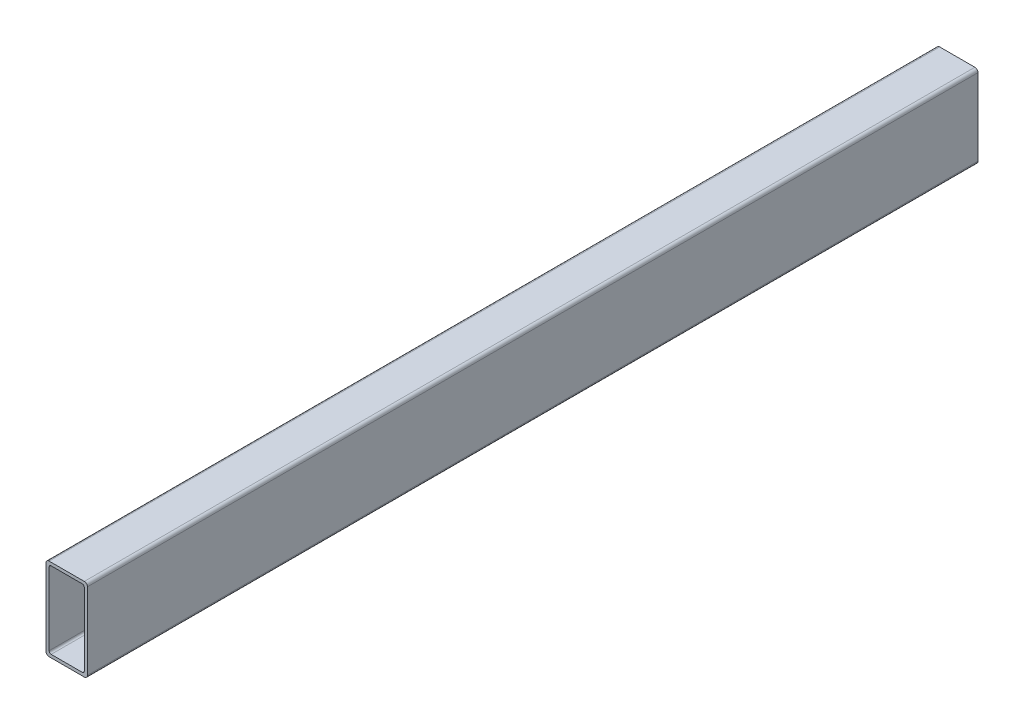
ISO-10303-21;
HEADER;
FILE_DESCRIPTION(('STEP AP214'),'2;1');
FILE_NAME('part.step','',(''),(''),'','','');
FILE_SCHEMA(('AUTOMOTIVE_DESIGN { 1 0 10303 214 1 1 1 1 }'));
ENDSEC;
DATA;
#1=APPLICATION_CONTEXT('core data for automotive mechanical design processes');
#2=APPLICATION_PROTOCOL_DEFINITION('international standard','automotive_design',2000,#1);
#3=PRODUCT_CONTEXT('',#1,'mechanical');
#4=PRODUCT('Part','Part','',(#3));
#5=PRODUCT_RELATED_PRODUCT_CATEGORY('part','',(#4));
#6=PRODUCT_DEFINITION_FORMATION('','',#4);
#7=PRODUCT_DEFINITION_CONTEXT('part definition',#1,'design');
#8=PRODUCT_DEFINITION('design','',#6,#7);
#9=PRODUCT_DEFINITION_SHAPE('','',#8);
#10=(LENGTH_UNIT() NAMED_UNIT(*) SI_UNIT(.MILLI.,.METRE.));
#11=(NAMED_UNIT(*) PLANE_ANGLE_UNIT() SI_UNIT($,.RADIAN.));
#12=(NAMED_UNIT(*) SI_UNIT($,.STERADIAN.) SOLID_ANGLE_UNIT());
#13=UNCERTAINTY_MEASURE_WITH_UNIT(LENGTH_MEASURE(1.E-05),#10,'distance_accuracy_value','');
#14=(GEOMETRIC_REPRESENTATION_CONTEXT(3) GLOBAL_UNCERTAINTY_ASSIGNED_CONTEXT((#13)) GLOBAL_UNIT_ASSIGNED_CONTEXT((#10,
#11,#12)) REPRESENTATION_CONTEXT('',''));
#15=CARTESIAN_POINT('',(0.,0.,0.));
#16=DIRECTION('',(0.,0.,1.));
#17=DIRECTION('',(1.,0.,0.));
#18=AXIS2_PLACEMENT_3D('',#15,#16,#17);
#19=CARTESIAN_POINT('',(18.5000000000001,38.5000000000001,259.721359549996));
#20=DIRECTION('',(0.,0.,-1.));
#21=DIRECTION('',(-1.,0.,0.));
#22=AXIS2_PLACEMENT_3D('',#19,#20,#21);
#23=CYLINDRICAL_SURFACE('',#22,1.5);
#24=DIRECTION('',(0.,0.,-1.));
#25=VECTOR('',#24,1.);
#26=CARTESIAN_POINT('',(18.5,40.0000000000001,259.721359549996));
#27=LINE('',#26,#25);
#28=CARTESIAN_POINT('',(18.5,40.0000000000001,215.));
#29=VERTEX_POINT('',#28);
#30=CARTESIAN_POINT('',(18.5,40.0000000000001,-215.));
#31=VERTEX_POINT('',#30);
#32=EDGE_CURVE('E109',#29,#31,#27,.T.);
#33=ORIENTED_EDGE('',*,*,#32,.F.);
#34=CARTESIAN_POINT('',(18.5000000000001,38.5000000000001,215.));
#35=DIRECTION('',(0.,0.,-1.));
#36=DIRECTION('',(0.,1.,0.));
#37=AXIS2_PLACEMENT_3D('',#34,#35,#36);
#38=CIRCLE('',#37,1.5);
#39=CARTESIAN_POINT('',(20.0000000000001,38.5000000000001,215.));
#40=VERTEX_POINT('',#39);
#41=EDGE_CURVE('E53',#29,#40,#38,.T.);
#42=ORIENTED_EDGE('',*,*,#41,.T.);
#43=DIRECTION('',(0.,0.,-1.));
#44=VECTOR('',#43,1.);
#45=CARTESIAN_POINT('',(20.0000000000001,38.5000000000001,259.721359549996));
#46=LINE('',#45,#44);
#47=CARTESIAN_POINT('',(20.0000000000001,38.5000000000001,-215.));
#48=VERTEX_POINT('',#47);
#49=EDGE_CURVE('E189',#40,#48,#46,.T.);
#50=ORIENTED_EDGE('',*,*,#49,.T.);
#51=CARTESIAN_POINT('',(18.5000000000001,38.5000000000001,-215.));
#52=DIRECTION('',(0.,0.,-1.));
#53=DIRECTION('',(0.,1.,0.));
#54=AXIS2_PLACEMENT_3D('',#51,#52,#53);
#55=CIRCLE('',#54,1.5);
#56=EDGE_CURVE('E273',#31,#48,#55,.T.);
#57=ORIENTED_EDGE('',*,*,#56,.F.);
#58=EDGE_LOOP('',(#33,#42,#50,#57));
#59=FACE_BOUND('',#58,.T.);
#60=ADVANCED_FACE('F34',(#59),#23,.T.);
#61=CARTESIAN_POINT('',(1.50000000000006,40.0000000000001,259.721359549996));
#62=DIRECTION('',(0.,-1.,0.));
#63=DIRECTION('',(0.,0.,-1.));
#64=AXIS2_PLACEMENT_3D('',#61,#62,#63);
#65=PLANE('',#64);
#66=DIRECTION('',(0.,0.,-1.));
#67=VECTOR('',#66,1.);
#68=CARTESIAN_POINT('',(1.50000000000006,40.0000000000001,259.721359549996));
#69=LINE('',#68,#67);
#70=CARTESIAN_POINT('',(1.50000000000006,40.0000000000001,215.));
#71=VERTEX_POINT('',#70);
#72=CARTESIAN_POINT('',(1.50000000000006,40.0000000000001,-215.));
#73=VERTEX_POINT('',#72);
#74=EDGE_CURVE('E140',#71,#73,#69,.T.);
#75=ORIENTED_EDGE('',*,*,#74,.F.);
#76=DIRECTION('',(1.,0.,0.));
#77=VECTOR('',#76,1.);
#78=CARTESIAN_POINT('',(1.50000000000006,40.0000000000001,215.));
#79=LINE('',#78,#77);
#80=EDGE_CURVE('E181',#71,#29,#79,.T.);
#81=ORIENTED_EDGE('',*,*,#80,.T.);
#82=ORIENTED_EDGE('',*,*,#32,.T.);
#83=DIRECTION('',(1.,0.,0.));
#84=VECTOR('',#83,1.);
#85=CARTESIAN_POINT('',(1.50000000000006,40.0000000000001,-215.));
#86=LINE('',#85,#84);
#87=EDGE_CURVE('E230',#73,#31,#86,.T.);
#88=ORIENTED_EDGE('',*,*,#87,.F.);
#89=EDGE_LOOP('',(#75,#81,#82,#88));
#90=FACE_BOUND('',#89,.T.);
#91=ADVANCED_FACE('F334',(#90),#65,.F.);
#92=CARTESIAN_POINT('',(1.50000000000006,38.5000000000001,259.721359549996));
#93=DIRECTION('',(0.,0.,-1.));
#94=DIRECTION('',(-1.,0.,0.));
#95=AXIS2_PLACEMENT_3D('',#92,#93,#94);
#96=CYLINDRICAL_SURFACE('',#95,1.50000000000001);
#97=DIRECTION('',(0.,0.,-1.));
#98=VECTOR('',#97,1.);
#99=CARTESIAN_POINT('',(0.,38.5000000000001,259.721359549996));
#100=LINE('',#99,#98);
#101=CARTESIAN_POINT('',(0.,38.5000000000001,215.));
#102=VERTEX_POINT('',#101);
#103=CARTESIAN_POINT('',(0.,38.5000000000001,-215.));
#104=VERTEX_POINT('',#103);
#105=EDGE_CURVE('E139',#102,#104,#100,.T.);
#106=ORIENTED_EDGE('',*,*,#105,.F.);
#107=CARTESIAN_POINT('',(1.50000000000006,38.5000000000001,215.));
#108=DIRECTION('',(0.,0.,-1.));
#109=DIRECTION('',(0.,1.,0.));
#110=AXIS2_PLACEMENT_3D('',#107,#108,#109);
#111=CIRCLE('',#110,1.50000000000001);
#112=EDGE_CURVE('E135',#102,#71,#111,.T.);
#113=ORIENTED_EDGE('',*,*,#112,.T.);
#114=ORIENTED_EDGE('',*,*,#74,.T.);
#115=CARTESIAN_POINT('',(1.50000000000006,38.5000000000001,-215.));
#116=DIRECTION('',(0.,0.,-1.));
#117=DIRECTION('',(0.,1.,0.));
#118=AXIS2_PLACEMENT_3D('',#115,#116,#117);
#119=CIRCLE('',#118,1.50000000000001);
#120=EDGE_CURVE('E221',#104,#73,#119,.T.);
#121=ORIENTED_EDGE('',*,*,#120,.F.);
#122=EDGE_LOOP('',(#106,#113,#114,#121));
#123=FACE_BOUND('',#122,.T.);
#124=ADVANCED_FACE('F215',(#123),#96,.T.);
#125=CARTESIAN_POINT('',(0.,38.5000000000001,259.721359549996));
#126=DIRECTION('',(1.,0.,0.));
#127=DIRECTION('',(0.,1.,0.));
#128=AXIS2_PLACEMENT_3D('',#125,#126,#127);
#129=PLANE('',#128);
#130=DIRECTION('',(0.,0.,-1.));
#131=VECTOR('',#130,1.);
#132=CARTESIAN_POINT('',(0.,1.50000000000006,259.721359549996));
#133=LINE('',#132,#131);
#134=CARTESIAN_POINT('',(0.,1.50000000000006,215.));
#135=VERTEX_POINT('',#134);
#136=CARTESIAN_POINT('',(0.,1.50000000000006,-215.));
#137=VERTEX_POINT('',#136);
#138=EDGE_CURVE('E144',#135,#137,#133,.T.);
#139=ORIENTED_EDGE('',*,*,#138,.F.);
#140=DIRECTION('',(0.,1.,0.));
#141=VECTOR('',#140,1.);
#142=CARTESIAN_POINT('',(0.,38.5000000000001,215.));
#143=LINE('',#142,#141);
#144=EDGE_CURVE('E129',#135,#102,#143,.T.);
#145=ORIENTED_EDGE('',*,*,#144,.T.);
#146=ORIENTED_EDGE('',*,*,#105,.T.);
#147=DIRECTION('',(0.,1.,0.));
#148=VECTOR('',#147,1.);
#149=CARTESIAN_POINT('',(0.,38.5000000000001,-215.));
#150=LINE('',#149,#148);
#151=EDGE_CURVE('E148',#137,#104,#150,.T.);
#152=ORIENTED_EDGE('',*,*,#151,.F.);
#153=EDGE_LOOP('',(#139,#145,#146,#152));
#154=FACE_BOUND('',#153,.T.);
#155=ADVANCED_FACE('F145',(#154),#129,.F.);
#156=CARTESIAN_POINT('',(1.50000000000006,1.50000000000006,259.721359549996));
#157=DIRECTION('',(0.,0.,-1.));
#158=DIRECTION('',(-1.,0.,0.));
#159=AXIS2_PLACEMENT_3D('',#156,#157,#158);
#160=CYLINDRICAL_SURFACE('',#159,1.5);
#161=DIRECTION('',(0.,0.,-1.));
#162=VECTOR('',#161,1.);
#163=CARTESIAN_POINT('',(1.50000000000006,0.,259.721359549996));
#164=LINE('',#163,#162);
#165=CARTESIAN_POINT('',(1.50000000000006,0.,215.));
#166=VERTEX_POINT('',#165);
#167=CARTESIAN_POINT('',(1.50000000000006,0.,-215.));
#168=VERTEX_POINT('',#167);
#169=EDGE_CURVE('E155',#166,#168,#164,.T.);
#170=ORIENTED_EDGE('',*,*,#169,.F.);
#171=CARTESIAN_POINT('',(1.50000000000006,1.50000000000006,215.));
#172=DIRECTION('',(0.,0.,-1.));
#173=DIRECTION('',(0.,1.,0.));
#174=AXIS2_PLACEMENT_3D('',#171,#172,#173);
#175=CIRCLE('',#174,1.5);
#176=EDGE_CURVE('E132',#166,#135,#175,.T.);
#177=ORIENTED_EDGE('',*,*,#176,.T.);
#178=ORIENTED_EDGE('',*,*,#138,.T.);
#179=CARTESIAN_POINT('',(1.50000000000006,1.50000000000006,-215.));
#180=DIRECTION('',(0.,0.,-1.));
#181=DIRECTION('',(0.,1.,0.));
#182=AXIS2_PLACEMENT_3D('',#179,#180,#181);
#183=CIRCLE('',#182,1.5);
#184=EDGE_CURVE('E226',#168,#137,#183,.T.);
#185=ORIENTED_EDGE('',*,*,#184,.F.);
#186=EDGE_LOOP('',(#170,#177,#178,#185));
#187=FACE_BOUND('',#186,.T.);
#188=ADVANCED_FACE('F153',(#187),#160,.T.);
#189=CARTESIAN_POINT('',(1.50000000000006,0.,259.721359549996));
#190=DIRECTION('',(0.,1.,0.));
#191=DIRECTION('',(0.,0.,1.));
#192=AXIS2_PLACEMENT_3D('',#189,#190,#191);
#193=PLANE('',#192);
#194=DIRECTION('',(0.,0.,-1.));
#195=VECTOR('',#194,1.);
#196=CARTESIAN_POINT('',(18.5,0.,259.721359549996));
#197=LINE('',#196,#195);
#198=CARTESIAN_POINT('',(18.5,0.,215.));
#199=VERTEX_POINT('',#198);
#200=CARTESIAN_POINT('',(18.5,0.,-215.));
#201=VERTEX_POINT('',#200);
#202=EDGE_CURVE('E162',#199,#201,#197,.T.);
#203=ORIENTED_EDGE('',*,*,#202,.F.);
#204=DIRECTION('',(-1.,0.,0.));
#205=VECTOR('',#204,1.);
#206=CARTESIAN_POINT('',(1.50000000000006,0.,215.));
#207=LINE('',#206,#205);
#208=EDGE_CURVE('E70',#199,#166,#207,.T.);
#209=ORIENTED_EDGE('',*,*,#208,.T.);
#210=ORIENTED_EDGE('',*,*,#169,.T.);
#211=DIRECTION('',(-1.,0.,0.));
#212=VECTOR('',#211,1.);
#213=CARTESIAN_POINT('',(1.50000000000006,0.,-215.));
#214=LINE('',#213,#212);
#215=EDGE_CURVE('E228',#201,#168,#214,.T.);
#216=ORIENTED_EDGE('',*,*,#215,.F.);
#217=EDGE_LOOP('',(#203,#209,#210,#216));
#218=FACE_BOUND('',#217,.T.);
#219=ADVANCED_FACE('F288',(#218),#193,.F.);
#220=CARTESIAN_POINT('',(18.5000000000001,1.50000000000006,259.721359549996));
#221=DIRECTION('',(0.,0.,-1.));
#222=DIRECTION('',(-1.,0.,0.));
#223=AXIS2_PLACEMENT_3D('',#220,#221,#222);
#224=CYLINDRICAL_SURFACE('',#223,1.5);
#225=DIRECTION('',(0.,0.,-1.));
#226=VECTOR('',#225,1.);
#227=CARTESIAN_POINT('',(20.0000000000001,1.50000000000006,259.721359549996));
#228=LINE('',#227,#226);
#229=CARTESIAN_POINT('',(20.0000000000001,1.50000000000006,215.));
#230=VERTEX_POINT('',#229);
#231=CARTESIAN_POINT('',(20.0000000000001,1.50000000000006,-215.));
#232=VERTEX_POINT('',#231);
#233=EDGE_CURVE('E166',#230,#232,#228,.T.);
#234=ORIENTED_EDGE('',*,*,#233,.F.);
#235=CARTESIAN_POINT('',(18.5000000000001,1.50000000000006,215.));
#236=DIRECTION('',(0.,0.,-1.));
#237=DIRECTION('',(0.,1.,0.));
#238=AXIS2_PLACEMENT_3D('',#235,#236,#237);
#239=CIRCLE('',#238,1.5);
#240=EDGE_CURVE('E64',#230,#199,#239,.T.);
#241=ORIENTED_EDGE('',*,*,#240,.T.);
#242=ORIENTED_EDGE('',*,*,#202,.T.);
#243=CARTESIAN_POINT('',(18.5000000000001,1.50000000000006,-215.));
#244=DIRECTION('',(0.,0.,-1.));
#245=DIRECTION('',(0.,1.,0.));
#246=AXIS2_PLACEMENT_3D('',#243,#244,#245);
#247=CIRCLE('',#246,1.5);
#248=EDGE_CURVE('E235',#232,#201,#247,.T.);
#249=ORIENTED_EDGE('',*,*,#248,.F.);
#250=EDGE_LOOP('',(#234,#241,#242,#249));
#251=FACE_BOUND('',#250,.T.);
#252=ADVANCED_FACE('F284',(#251),#224,.T.);
#253=CARTESIAN_POINT('',(20.0000000000001,38.5000000000001,259.721359549996));
#254=DIRECTION('',(-1.,0.,0.));
#255=DIRECTION('',(0.,-1.,0.));
#256=AXIS2_PLACEMENT_3D('',#253,#254,#255);
#257=PLANE('',#256);
#258=ORIENTED_EDGE('',*,*,#49,.F.);
#259=DIRECTION('',(0.,-1.,0.));
#260=VECTOR('',#259,1.);
#261=CARTESIAN_POINT('',(20.0000000000001,38.5000000000001,215.));
#262=LINE('',#261,#260);
#263=EDGE_CURVE('E163',#40,#230,#262,.T.);
#264=ORIENTED_EDGE('',*,*,#263,.T.);
#265=ORIENTED_EDGE('',*,*,#233,.T.);
#266=DIRECTION('',(0.,-1.,0.));
#267=VECTOR('',#266,1.);
#268=CARTESIAN_POINT('',(20.0000000000001,38.5000000000001,-215.));
#269=LINE('',#268,#267);
#270=EDGE_CURVE('E238',#48,#232,#269,.T.);
#271=ORIENTED_EDGE('',*,*,#270,.F.);
#272=EDGE_LOOP('',(#258,#264,#265,#271));
#273=FACE_BOUND('',#272,.T.);
#274=ADVANCED_FACE('F280',(#273),#257,.F.);
#275=CARTESIAN_POINT('',(17.5000000000001,2.50000000000006,259.721359549996));
#276=DIRECTION('',(0.,0.,-1.));
#277=DIRECTION('',(-1.,0.,0.));
#278=AXIS2_PLACEMENT_3D('',#275,#276,#277);
#279=CYLINDRICAL_SURFACE('',#278,0.999999999999994);
#280=CARTESIAN_POINT('',(17.5000000000001,2.50000000000006,215.));
#281=DIRECTION('',(0.,0.,-1.));
#282=DIRECTION('',(0.,1.,0.));
#283=AXIS2_PLACEMENT_3D('',#280,#281,#282);
#284=CIRCLE('',#283,0.999999999999994);
#285=CARTESIAN_POINT('',(18.5000000000001,2.50000000000006,215.));
#286=VERTEX_POINT('',#285);
#287=CARTESIAN_POINT('',(17.5000000000001,1.50000000000007,215.));
#288=VERTEX_POINT('',#287);
#289=EDGE_CURVE('E101',#286,#288,#284,.T.);
#290=ORIENTED_EDGE('',*,*,#289,.F.);
#291=DIRECTION('',(0.,0.,-1.));
#292=VECTOR('',#291,1.);
#293=CARTESIAN_POINT('',(18.5000000000001,2.50000000000006,259.721359549996));
#294=LINE('',#293,#292);
#295=CARTESIAN_POINT('',(18.5000000000001,2.50000000000006,-215.));
#296=VERTEX_POINT('',#295);
#297=EDGE_CURVE('E188',#286,#296,#294,.T.);
#298=ORIENTED_EDGE('',*,*,#297,.T.);
#299=CARTESIAN_POINT('',(17.5000000000001,2.50000000000006,-215.));
#300=DIRECTION('',(0.,0.,-1.));
#301=DIRECTION('',(0.,1.,0.));
#302=AXIS2_PLACEMENT_3D('',#299,#300,#301);
#303=CIRCLE('',#302,0.999999999999994);
#304=CARTESIAN_POINT('',(17.5000000000001,1.50000000000007,-215.));
#305=VERTEX_POINT('',#304);
#306=EDGE_CURVE('E241',#296,#305,#303,.T.);
#307=ORIENTED_EDGE('',*,*,#306,.T.);
#308=DIRECTION('',(0.,0.,-1.));
#309=VECTOR('',#308,1.);
#310=CARTESIAN_POINT('',(17.5000000000001,1.50000000000007,259.721359549996));
#311=LINE('',#310,#309);
#312=EDGE_CURVE('E167',#288,#305,#311,.T.);
#313=ORIENTED_EDGE('',*,*,#312,.F.);
#314=EDGE_LOOP('',(#290,#298,#307,#313));
#315=FACE_BOUND('',#314,.T.);
#316=ADVANCED_FACE('F306',(#315),#279,.F.);
#317=CARTESIAN_POINT('',(18.5000000000001,37.5000000000001,259.721359549996));
#318=DIRECTION('',(-1.,0.,0.));
#319=DIRECTION('',(0.,-1.,0.));
#320=AXIS2_PLACEMENT_3D('',#317,#318,#319);
#321=PLANE('',#320);
#322=DIRECTION('',(0.,-1.,0.));
#323=VECTOR('',#322,1.);
#324=CARTESIAN_POINT('',(18.5000000000001,37.5000000000001,215.));
#325=LINE('',#324,#323);
#326=CARTESIAN_POINT('',(18.5000000000001,37.5000000000001,215.));
#327=VERTEX_POINT('',#326);
#328=EDGE_CURVE('E11',#327,#286,#325,.T.);
#329=ORIENTED_EDGE('',*,*,#328,.F.);
#330=DIRECTION('',(0.,0.,-1.));
#331=VECTOR('',#330,1.);
#332=CARTESIAN_POINT('',(18.5000000000001,37.5000000000001,259.721359549996));
#333=LINE('',#332,#331);
#334=CARTESIAN_POINT('',(18.5000000000001,37.5000000000001,-215.));
#335=VERTEX_POINT('',#334);
#336=EDGE_CURVE('E193',#327,#335,#333,.T.);
#337=ORIENTED_EDGE('',*,*,#336,.T.);
#338=DIRECTION('',(0.,-1.,0.));
#339=VECTOR('',#338,1.);
#340=CARTESIAN_POINT('',(18.5000000000001,37.5000000000001,-215.));
#341=LINE('',#340,#339);
#342=EDGE_CURVE('E213',#335,#296,#341,.T.);
#343=ORIENTED_EDGE('',*,*,#342,.T.);
#344=ORIENTED_EDGE('',*,*,#297,.F.);
#345=EDGE_LOOP('',(#329,#337,#343,#344));
#346=FACE_BOUND('',#345,.T.);
#347=ADVANCED_FACE('F310',(#346),#321,.T.);
#348=CARTESIAN_POINT('',(17.5000000000001,37.5000000000001,259.721359549996));
#349=DIRECTION('',(0.,0.,-1.));
#350=DIRECTION('',(-1.,0.,0.));
#351=AXIS2_PLACEMENT_3D('',#348,#349,#350);
#352=CYLINDRICAL_SURFACE('',#351,1.);
#353=CARTESIAN_POINT('',(17.5000000000001,37.5000000000001,215.));
#354=DIRECTION('',(0.,0.,-1.));
#355=DIRECTION('',(0.,1.,0.));
#356=AXIS2_PLACEMENT_3D('',#353,#354,#355);
#357=CIRCLE('',#356,1.);
#358=CARTESIAN_POINT('',(17.5000000000001,38.5000000000001,215.));
#359=VERTEX_POINT('',#358);
#360=EDGE_CURVE('E44',#359,#327,#357,.T.);
#361=ORIENTED_EDGE('',*,*,#360,.F.);
#362=DIRECTION('',(0.,0.,-1.));
#363=VECTOR('',#362,1.);
#364=CARTESIAN_POINT('',(17.5000000000001,38.5000000000001,259.721359549996));
#365=LINE('',#364,#363);
#366=CARTESIAN_POINT('',(17.5000000000001,38.5000000000001,-215.));
#367=VERTEX_POINT('',#366);
#368=EDGE_CURVE('E196',#359,#367,#365,.T.);
#369=ORIENTED_EDGE('',*,*,#368,.T.);
#370=CARTESIAN_POINT('',(17.5000000000001,37.5000000000001,-215.));
#371=DIRECTION('',(0.,0.,-1.));
#372=DIRECTION('',(0.,1.,0.));
#373=AXIS2_PLACEMENT_3D('',#370,#371,#372);
#374=CIRCLE('',#373,1.);
#375=EDGE_CURVE('E247',#367,#335,#374,.T.);
#376=ORIENTED_EDGE('',*,*,#375,.T.);
#377=ORIENTED_EDGE('',*,*,#336,.F.);
#378=EDGE_LOOP('',(#361,#369,#376,#377));
#379=FACE_BOUND('',#378,.T.);
#380=ADVANCED_FACE('F316',(#379),#352,.F.);
#381=CARTESIAN_POINT('',(2.50000000000006,38.5000000000001,259.721359549996));
#382=DIRECTION('',(0.,-1.,0.));
#383=DIRECTION('',(1.,0.,0.));
#384=AXIS2_PLACEMENT_3D('',#381,#382,#383);
#385=PLANE('',#384);
#386=DIRECTION('',(1.,0.,0.));
#387=VECTOR('',#386,1.);
#388=CARTESIAN_POINT('',(2.50000000000006,38.5000000000001,215.));
#389=LINE('',#388,#387);
#390=CARTESIAN_POINT('',(2.50000000000006,38.5000000000001,215.));
#391=VERTEX_POINT('',#390);
#392=EDGE_CURVE('E170',#391,#359,#389,.T.);
#393=ORIENTED_EDGE('',*,*,#392,.F.);
#394=DIRECTION('',(0.,0.,-1.));
#395=VECTOR('',#394,1.);
#396=CARTESIAN_POINT('',(2.50000000000006,38.5000000000001,259.721359549996));
#397=LINE('',#396,#395);
#398=CARTESIAN_POINT('',(2.50000000000006,38.5000000000001,-215.));
#399=VERTEX_POINT('',#398);
#400=EDGE_CURVE('E199',#391,#399,#397,.T.);
#401=ORIENTED_EDGE('',*,*,#400,.T.);
#402=DIRECTION('',(1.,0.,0.));
#403=VECTOR('',#402,1.);
#404=CARTESIAN_POINT('',(2.50000000000006,38.5000000000001,-215.));
#405=LINE('',#404,#403);
#406=EDGE_CURVE('E250',#399,#367,#405,.T.);
#407=ORIENTED_EDGE('',*,*,#406,.T.);
#408=ORIENTED_EDGE('',*,*,#368,.F.);
#409=EDGE_LOOP('',(#393,#401,#407,#408));
#410=FACE_BOUND('',#409,.T.);
#411=ADVANCED_FACE('F320',(#410),#385,.T.);
#412=CARTESIAN_POINT('',(2.50000000000006,37.5000000000001,259.721359549996));
#413=DIRECTION('',(0.,0.,-1.));
#414=DIRECTION('',(-1.,0.,0.));
#415=AXIS2_PLACEMENT_3D('',#412,#413,#414);
#416=CYLINDRICAL_SURFACE('',#415,1.);
#417=CARTESIAN_POINT('',(2.50000000000006,37.5000000000001,215.));
#418=DIRECTION('',(0.,0.,-1.));
#419=DIRECTION('',(0.,1.,0.));
#420=AXIS2_PLACEMENT_3D('',#417,#418,#419);
#421=CIRCLE('',#420,1.);
#422=CARTESIAN_POINT('',(1.50000000000006,37.5000000000001,215.));
#423=VERTEX_POINT('',#422);
#424=EDGE_CURVE('E172',#423,#391,#421,.T.);
#425=ORIENTED_EDGE('',*,*,#424,.F.);
#426=DIRECTION('',(0.,0.,-1.));
#427=VECTOR('',#426,1.);
#428=CARTESIAN_POINT('',(1.50000000000006,37.5000000000001,259.721359549996));
#429=LINE('',#428,#427);
#430=CARTESIAN_POINT('',(1.50000000000006,37.5000000000001,-215.));
#431=VERTEX_POINT('',#430);
#432=EDGE_CURVE('E202',#423,#431,#429,.T.);
#433=ORIENTED_EDGE('',*,*,#432,.T.);
#434=CARTESIAN_POINT('',(2.50000000000006,37.5000000000001,-215.));
#435=DIRECTION('',(0.,0.,-1.));
#436=DIRECTION('',(0.,1.,0.));
#437=AXIS2_PLACEMENT_3D('',#434,#435,#436);
#438=CIRCLE('',#437,1.);
#439=EDGE_CURVE('E253',#431,#399,#438,.T.);
#440=ORIENTED_EDGE('',*,*,#439,.T.);
#441=ORIENTED_EDGE('',*,*,#400,.F.);
#442=EDGE_LOOP('',(#425,#433,#440,#441));
#443=FACE_BOUND('',#442,.T.);
#444=ADVANCED_FACE('F323',(#443),#416,.F.);
#445=CARTESIAN_POINT('',(1.50000000000006,37.5000000000001,259.721359549996));
#446=DIRECTION('',(1.,0.,0.));
#447=DIRECTION('',(0.,1.,0.));
#448=AXIS2_PLACEMENT_3D('',#445,#446,#447);
#449=PLANE('',#448);
#450=DIRECTION('',(0.,1.,0.));
#451=VECTOR('',#450,1.);
#452=CARTESIAN_POINT('',(1.50000000000006,37.5000000000001,215.));
#453=LINE('',#452,#451);
#454=CARTESIAN_POINT('',(1.50000000000006,2.50000000000006,215.));
#455=VERTEX_POINT('',#454);
#456=EDGE_CURVE('E173',#455,#423,#453,.T.);
#457=ORIENTED_EDGE('',*,*,#456,.F.);
#458=DIRECTION('',(0.,0.,-1.));
#459=VECTOR('',#458,1.);
#460=CARTESIAN_POINT('',(1.50000000000006,2.50000000000006,259.721359549996));
#461=LINE('',#460,#459);
#462=CARTESIAN_POINT('',(1.50000000000006,2.50000000000006,-215.));
#463=VERTEX_POINT('',#462);
#464=EDGE_CURVE('E205',#455,#463,#461,.T.);
#465=ORIENTED_EDGE('',*,*,#464,.T.);
#466=DIRECTION('',(0.,1.,0.));
#467=VECTOR('',#466,1.);
#468=CARTESIAN_POINT('',(1.50000000000006,37.5000000000001,-215.));
#469=LINE('',#468,#467);
#470=EDGE_CURVE('E255',#463,#431,#469,.T.);
#471=ORIENTED_EDGE('',*,*,#470,.T.);
#472=ORIENTED_EDGE('',*,*,#432,.F.);
#473=EDGE_LOOP('',(#457,#465,#471,#472));
#474=FACE_BOUND('',#473,.T.);
#475=ADVANCED_FACE('F324',(#474),#449,.T.);
#476=CARTESIAN_POINT('',(2.50000000000006,2.50000000000006,259.721359549996));
#477=DIRECTION('',(0.,0.,-1.));
#478=DIRECTION('',(-1.,0.,0.));
#479=AXIS2_PLACEMENT_3D('',#476,#477,#478);
#480=CYLINDRICAL_SURFACE('',#479,0.999999999999997);
#481=CARTESIAN_POINT('',(2.50000000000006,2.50000000000006,215.));
#482=DIRECTION('',(0.,0.,-1.));
#483=DIRECTION('',(0.,1.,0.));
#484=AXIS2_PLACEMENT_3D('',#481,#482,#483);
#485=CIRCLE('',#484,0.999999999999997);
#486=CARTESIAN_POINT('',(2.50000000000006,1.50000000000006,215.));
#487=VERTEX_POINT('',#486);
#488=EDGE_CURVE('E38',#487,#455,#485,.T.);
#489=ORIENTED_EDGE('',*,*,#488,.F.);
#490=DIRECTION('',(0.,0.,-1.));
#491=VECTOR('',#490,1.);
#492=CARTESIAN_POINT('',(2.50000000000006,1.50000000000006,259.721359549996));
#493=LINE('',#492,#491);
#494=CARTESIAN_POINT('',(2.50000000000006,1.50000000000006,-215.));
#495=VERTEX_POINT('',#494);
#496=EDGE_CURVE('E208',#487,#495,#493,.T.);
#497=ORIENTED_EDGE('',*,*,#496,.T.);
#498=CARTESIAN_POINT('',(2.50000000000006,2.50000000000006,-215.));
#499=DIRECTION('',(0.,0.,-1.));
#500=DIRECTION('',(0.,1.,0.));
#501=AXIS2_PLACEMENT_3D('',#498,#499,#500);
#502=CIRCLE('',#501,0.999999999999997);
#503=EDGE_CURVE('E178',#495,#463,#502,.T.);
#504=ORIENTED_EDGE('',*,*,#503,.T.);
#505=ORIENTED_EDGE('',*,*,#464,.F.);
#506=EDGE_LOOP('',(#489,#497,#504,#505));
#507=FACE_BOUND('',#506,.T.);
#508=ADVANCED_FACE('F300',(#507),#480,.F.);
#509=CARTESIAN_POINT('',(2.50000000000006,1.50000000000006,259.721359549996));
#510=DIRECTION('',(0.,1.,0.));
#511=DIRECTION('',(-1.,0.,0.));
#512=AXIS2_PLACEMENT_3D('',#509,#510,#511);
#513=PLANE('',#512);
#514=DIRECTION('',(-1.,0.,0.));
#515=VECTOR('',#514,1.);
#516=CARTESIAN_POINT('',(2.50000000000006,1.50000000000006,215.));
#517=LINE('',#516,#515);
#518=EDGE_CURVE('E98',#288,#487,#517,.T.);
#519=ORIENTED_EDGE('',*,*,#518,.F.);
#520=ORIENTED_EDGE('',*,*,#312,.T.);
#521=DIRECTION('',(-1.,0.,0.));
#522=VECTOR('',#521,1.);
#523=CARTESIAN_POINT('',(2.50000000000006,1.50000000000006,-215.));
#524=LINE('',#523,#522);
#525=EDGE_CURVE('E244',#305,#495,#524,.T.);
#526=ORIENTED_EDGE('',*,*,#525,.T.);
#527=ORIENTED_EDGE('',*,*,#496,.F.);
#528=EDGE_LOOP('',(#519,#520,#526,#527));
#529=FACE_BOUND('',#528,.T.);
#530=ADVANCED_FACE('F301',(#529),#513,.T.);
#531=CARTESIAN_POINT('',(0.,38.5,215.));
#532=DIRECTION('',(0.,0.,-1.));
#533=DIRECTION('',(0.,1.,0.));
#534=AXIS2_PLACEMENT_3D('',#531,#532,#533);
#535=PLANE('',#534);
#536=ORIENTED_EDGE('',*,*,#289,.T.);
#537=ORIENTED_EDGE('',*,*,#518,.T.);
#538=ORIENTED_EDGE('',*,*,#488,.T.);
#539=ORIENTED_EDGE('',*,*,#456,.T.);
#540=ORIENTED_EDGE('',*,*,#424,.T.);
#541=ORIENTED_EDGE('',*,*,#392,.T.);
#542=ORIENTED_EDGE('',*,*,#360,.T.);
#543=ORIENTED_EDGE('',*,*,#328,.T.);
#544=EDGE_LOOP('',(#536,#537,#538,#539,#540,#541,#542,#543));
#545=FACE_BOUND('',#544,.T.);
#546=ORIENTED_EDGE('',*,*,#80,.F.);
#547=ORIENTED_EDGE('',*,*,#112,.F.);
#548=ORIENTED_EDGE('',*,*,#144,.F.);
#549=ORIENTED_EDGE('',*,*,#176,.F.);
#550=ORIENTED_EDGE('',*,*,#208,.F.);
#551=ORIENTED_EDGE('',*,*,#240,.F.);
#552=ORIENTED_EDGE('',*,*,#263,.F.);
#553=ORIENTED_EDGE('',*,*,#41,.F.);
#554=EDGE_LOOP('',(#546,#547,#548,#549,#550,#551,#552,#553));
#555=FACE_BOUND('',#554,.T.);
#556=ADVANCED_FACE('F36',(#545,#555),#535,.F.);
#557=CARTESIAN_POINT('',(0.,38.5,-215.));
#558=DIRECTION('',(0.,0.,1.));
#559=DIRECTION('',(0.,1.,0.));
#560=AXIS2_PLACEMENT_3D('',#557,#558,#559);
#561=PLANE('',#560);
#562=ORIENTED_EDGE('',*,*,#306,.F.);
#563=ORIENTED_EDGE('',*,*,#342,.F.);
#564=ORIENTED_EDGE('',*,*,#375,.F.);
#565=ORIENTED_EDGE('',*,*,#406,.F.);
#566=ORIENTED_EDGE('',*,*,#439,.F.);
#567=ORIENTED_EDGE('',*,*,#470,.F.);
#568=ORIENTED_EDGE('',*,*,#503,.F.);
#569=ORIENTED_EDGE('',*,*,#525,.F.);
#570=EDGE_LOOP('',(#562,#563,#564,#565,#566,#567,#568,#569));
#571=FACE_BOUND('',#570,.T.);
#572=ORIENTED_EDGE('',*,*,#87,.T.);
#573=ORIENTED_EDGE('',*,*,#56,.T.);
#574=ORIENTED_EDGE('',*,*,#270,.T.);
#575=ORIENTED_EDGE('',*,*,#248,.T.);
#576=ORIENTED_EDGE('',*,*,#215,.T.);
#577=ORIENTED_EDGE('',*,*,#184,.T.);
#578=ORIENTED_EDGE('',*,*,#151,.T.);
#579=ORIENTED_EDGE('',*,*,#120,.T.);
#580=EDGE_LOOP('',(#572,#573,#574,#575,#576,#577,#578,#579));
#581=FACE_BOUND('',#580,.T.);
#582=ADVANCED_FACE('F224',(#571,#581),#561,.F.);
#583=CLOSED_SHELL('',(#60,#91,#124,#155,#188,#219,#252,#274,#316,#347,#380,#411,#444,#475,#508,
#530,#556,#582));
#584=MANIFOLD_SOLID_BREP('B2',#583);
#585=ADVANCED_BREP_SHAPE_REPRESENTATION('',(#18,#584),#14);
#586=SHAPE_DEFINITION_REPRESENTATION(#9,#585);
ENDSEC;
END-ISO-10303-21;
